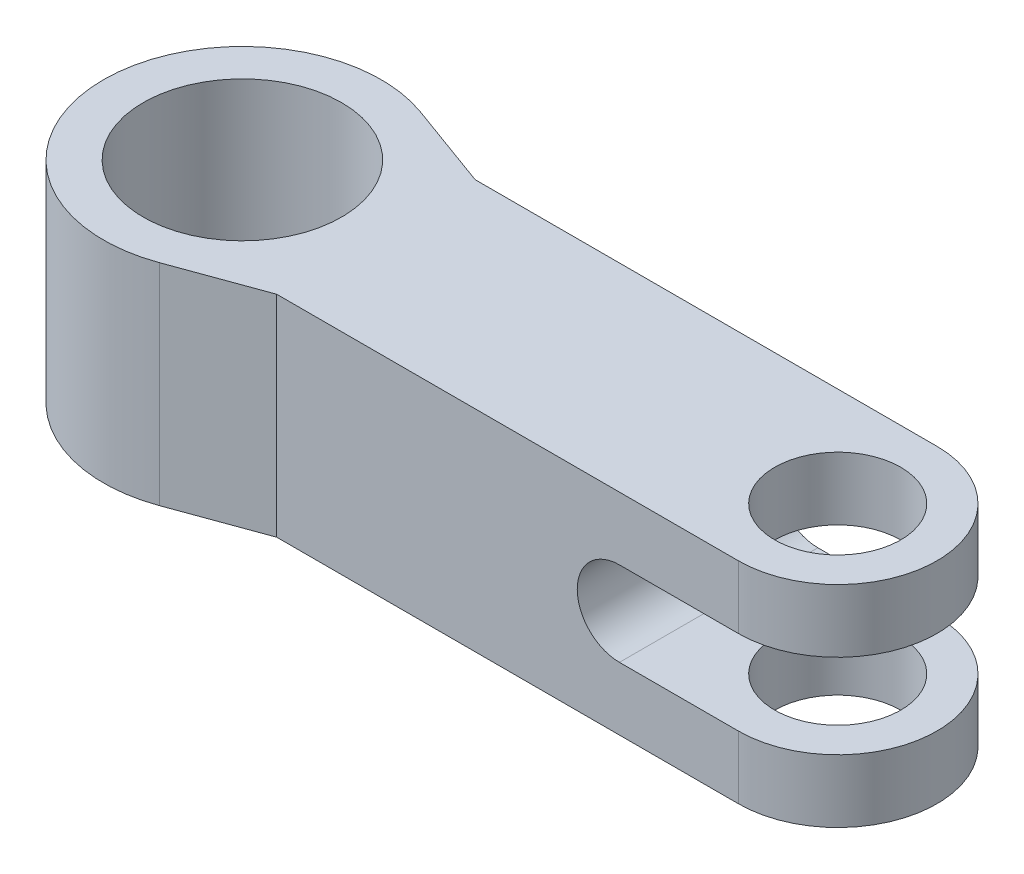
ISO-10303-21;
HEADER;
FILE_DESCRIPTION(('STEP AP214'),'2;1');
FILE_NAME('part.step','',(''),(''),'','','');
FILE_SCHEMA(('AUTOMOTIVE_DESIGN { 1 0 10303 214 1 1 1 1 }'));
ENDSEC;
DATA;
#1=APPLICATION_CONTEXT('core data for automotive mechanical design processes');
#2=APPLICATION_PROTOCOL_DEFINITION('international standard','automotive_design',2000,#1);
#3=PRODUCT_CONTEXT('',#1,'mechanical');
#4=PRODUCT('Part','Part','',(#3));
#5=PRODUCT_RELATED_PRODUCT_CATEGORY('part','',(#4));
#6=PRODUCT_DEFINITION_FORMATION('','',#4);
#7=PRODUCT_DEFINITION_CONTEXT('part definition',#1,'design');
#8=PRODUCT_DEFINITION('design','',#6,#7);
#9=PRODUCT_DEFINITION_SHAPE('','',#8);
#10=(LENGTH_UNIT() NAMED_UNIT(*) SI_UNIT(.MILLI.,.METRE.));
#11=(NAMED_UNIT(*) PLANE_ANGLE_UNIT() SI_UNIT($,.RADIAN.));
#12=(NAMED_UNIT(*) SI_UNIT($,.STERADIAN.) SOLID_ANGLE_UNIT());
#13=UNCERTAINTY_MEASURE_WITH_UNIT(LENGTH_MEASURE(1.E-05),#10,'distance_accuracy_value','');
#14=(GEOMETRIC_REPRESENTATION_CONTEXT(3) GLOBAL_UNCERTAINTY_ASSIGNED_CONTEXT((#13)) GLOBAL_UNIT_ASSIGNED_CONTEXT((#10,
#11,#12)) REPRESENTATION_CONTEXT('',''));
#15=CARTESIAN_POINT('',(0.,0.,0.));
#16=DIRECTION('',(0.,0.,1.));
#17=DIRECTION('',(1.,0.,0.));
#18=AXIS2_PLACEMENT_3D('',#15,#16,#17);
#19=CARTESIAN_POINT('',(16.,-44.175,0.));
#20=DIRECTION('',(0.,-1.,0.));
#21=DIRECTION('',(1.,0.,0.));
#22=AXIS2_PLACEMENT_3D('',#19,#20,#21);
#23=PLANE('',#22);
#24=CARTESIAN_POINT('',(32.,-44.175,0.));
#25=DIRECTION('',(0.,-1.,0.));
#26=DIRECTION('',(0.,0.,-1.));
#27=AXIS2_PLACEMENT_3D('',#24,#25,#26);
#28=CIRCLE('',#27,3.175);
#29=CARTESIAN_POINT('',(32.,-44.175,-3.175));
#30=VERTEX_POINT('',#29);
#31=EDGE_CURVE('E190',#30,#30,#28,.T.);
#32=ORIENTED_EDGE('',*,*,#31,.F.);
#33=EDGE_LOOP('',(#32));
#34=FACE_BOUND('',#33,.T.);
#35=DIRECTION('',(1.,0.,0.));
#36=VECTOR('',#35,1.);
#37=CARTESIAN_POINT('',(20.3646218519343,-44.175,5.));
#38=LINE('',#37,#36);
#39=CARTESIAN_POINT('',(26.,-44.175,5.));
#40=VERTEX_POINT('',#39);
#41=CARTESIAN_POINT('',(32.,-44.175,5.));
#42=VERTEX_POINT('',#41);
#43=EDGE_CURVE('E42',#40,#42,#38,.T.);
#44=ORIENTED_EDGE('',*,*,#43,.F.);
#45=DIRECTION('',(0.,0.,-1.));
#46=VECTOR('',#45,1.);
#47=CARTESIAN_POINT('',(26.,-44.175,0.));
#48=LINE('',#47,#46);
#49=CARTESIAN_POINT('',(26.,-44.175,-5.));
#50=VERTEX_POINT('',#49);
#51=EDGE_CURVE('E200',#40,#50,#48,.T.);
#52=ORIENTED_EDGE('',*,*,#51,.T.);
#53=DIRECTION('',(1.,0.,0.));
#54=VECTOR('',#53,1.);
#55=CARTESIAN_POINT('',(20.3646218519343,-44.175,-5.));
#56=LINE('',#55,#54);
#57=CARTESIAN_POINT('',(32.,-44.175,-5.));
#58=VERTEX_POINT('',#57);
#59=EDGE_CURVE('E176',#50,#58,#56,.T.);
#60=ORIENTED_EDGE('',*,*,#59,.T.);
#61=CARTESIAN_POINT('',(32.,-44.175,0.));
#62=DIRECTION('',(0.,-1.,0.));
#63=DIRECTION('',(0.,0.,-1.));
#64=AXIS2_PLACEMENT_3D('',#61,#62,#63);
#65=CIRCLE('',#64,5.);
#66=EDGE_CURVE('E189',#58,#42,#65,.T.);
#67=ORIENTED_EDGE('',*,*,#66,.T.);
#68=EDGE_LOOP('',(#44,#52,#60,#67));
#69=FACE_BOUND('',#68,.T.);
#70=ADVANCED_FACE('F17',(#34,#69),#23,.T.);
#71=CARTESIAN_POINT('',(2.,-44.302,0.));
#72=DIRECTION('',(0.,1.,0.));
#73=DIRECTION('',(0.,0.,1.));
#74=AXIS2_PLACEMENT_3D('',#71,#72,#73);
#75=CYLINDRICAL_SURFACE('',#74,7.);
#76=CARTESIAN_POINT('',(2.,-41.,0.));
#77=DIRECTION('',(0.,-1.,0.));
#78=DIRECTION('',(0.,0.,-1.));
#79=AXIS2_PLACEMENT_3D('',#76,#77,#78);
#80=CIRCLE('',#79,7.);
#81=CARTESIAN_POINT('',(4.39414100327968,-41.,6.57784834550136));
#82=VERTEX_POINT('',#81);
#83=CARTESIAN_POINT('',(4.39414100327967,-41.,-6.57784834550136));
#84=VERTEX_POINT('',#83);
#85=EDGE_CURVE('E163',#82,#84,#80,.T.);
#86=ORIENTED_EDGE('',*,*,#85,.T.);
#87=DIRECTION('',(0.,1.,0.));
#88=VECTOR('',#87,1.);
#89=CARTESIAN_POINT('',(4.39414100327967,-44.302,-6.57784834550136));
#90=LINE('',#89,#88);
#91=CARTESIAN_POINT('',(4.39414100327967,-51.604,-6.57784834550136));
#92=VERTEX_POINT('',#91);
#93=EDGE_CURVE('E11',#92,#84,#90,.T.);
#94=ORIENTED_EDGE('',*,*,#93,.F.);
#95=CARTESIAN_POINT('',(2.,-51.604,0.));
#96=DIRECTION('',(0.,-1.,0.));
#97=DIRECTION('',(0.,0.,-1.));
#98=AXIS2_PLACEMENT_3D('',#95,#96,#97);
#99=CIRCLE('',#98,7.);
#100=CARTESIAN_POINT('',(4.39414100327968,-51.604,6.57784834550136));
#101=VERTEX_POINT('',#100);
#102=EDGE_CURVE('E232',#101,#92,#99,.T.);
#103=ORIENTED_EDGE('',*,*,#102,.F.);
#104=DIRECTION('',(0.,1.,0.));
#105=VECTOR('',#104,1.);
#106=CARTESIAN_POINT('',(4.39414100327968,-44.302,6.57784834550136));
#107=LINE('',#106,#105);
#108=EDGE_CURVE('E149',#101,#82,#107,.T.);
#109=ORIENTED_EDGE('',*,*,#108,.T.);
#110=EDGE_LOOP('',(#86,#94,#103,#109));
#111=FACE_BOUND('',#110,.T.);
#112=ADVANCED_FACE('F427',(#111),#75,.T.);
#113=CARTESIAN_POINT('',(6.56169235357409,-44.302,-5.78892417275068));
#114=DIRECTION('',(-0.342020143325668,0.,0.939692620785908));
#115=DIRECTION('',(0.939692620785909,0.,0.342020143325668));
#116=AXIS2_PLACEMENT_3D('',#113,#114,#115);
#117=PLANE('',#116);
#118=DIRECTION('',(0.939692620785909,0.,0.342020143325668));
#119=VECTOR('',#118,1.);
#120=CARTESIAN_POINT('',(6.56169235357409,-41.,-5.78892417275068));
#121=LINE('',#120,#119);
#122=CARTESIAN_POINT('',(8.7292437038685,-41.,-5.));
#123=VERTEX_POINT('',#122);
#124=EDGE_CURVE('E261',#84,#123,#121,.T.);
#125=ORIENTED_EDGE('',*,*,#124,.T.);
#126=DIRECTION('',(0.,1.,0.));
#127=VECTOR('',#126,1.);
#128=CARTESIAN_POINT('',(8.7292437038685,-44.302,-5.));
#129=LINE('',#128,#127);
#130=CARTESIAN_POINT('',(8.7292437038685,-51.604,-5.));
#131=VERTEX_POINT('',#130);
#132=EDGE_CURVE('E28',#131,#123,#129,.T.);
#133=ORIENTED_EDGE('',*,*,#132,.F.);
#134=DIRECTION('',(0.939692620785909,0.,0.342020143325668));
#135=VECTOR('',#134,1.);
#136=CARTESIAN_POINT('',(6.56169235357409,-51.604,-5.78892417275068));
#137=LINE('',#136,#135);
#138=EDGE_CURVE('E236',#92,#131,#137,.T.);
#139=ORIENTED_EDGE('',*,*,#138,.F.);
#140=ORIENTED_EDGE('',*,*,#93,.T.);
#141=EDGE_LOOP('',(#125,#133,#139,#140));
#142=FACE_BOUND('',#141,.T.);
#143=ADVANCED_FACE('F421',(#142),#117,.F.);
#144=CARTESIAN_POINT('',(20.3646218519343,-44.302,-5.));
#145=DIRECTION('',(0.,0.,1.));
#146=DIRECTION('',(1.,0.,0.));
#147=AXIS2_PLACEMENT_3D('',#144,#145,#146);
#148=PLANE('',#147);
#149=ORIENTED_EDGE('',*,*,#59,.F.);
#150=CARTESIAN_POINT('',(26.,-46.302,-5.));
#151=DIRECTION('',(0.,0.,1.));
#152=DIRECTION('',(1.,0.,0.));
#153=AXIS2_PLACEMENT_3D('',#150,#151,#152);
#154=CIRCLE('',#153,2.127);
#155=CARTESIAN_POINT('',(26.,-48.429,-5.));
#156=VERTEX_POINT('',#155);
#157=EDGE_CURVE('E92',#50,#156,#154,.T.);
#158=ORIENTED_EDGE('',*,*,#157,.T.);
#159=DIRECTION('',(1.,0.,0.));
#160=VECTOR('',#159,1.);
#161=CARTESIAN_POINT('',(20.3646218519343,-48.429,-5.));
#162=LINE('',#161,#160);
#163=CARTESIAN_POINT('',(32.,-48.429,-5.));
#164=VERTEX_POINT('',#163);
#165=EDGE_CURVE('E67',#156,#164,#162,.T.);
#166=ORIENTED_EDGE('',*,*,#165,.T.);
#167=DIRECTION('',(0.,1.,0.));
#168=VECTOR('',#167,1.);
#169=CARTESIAN_POINT('',(32.,-51.604,-5.));
#170=LINE('',#169,#168);
#171=CARTESIAN_POINT('',(32.,-51.604,-5.));
#172=VERTEX_POINT('',#171);
#173=EDGE_CURVE('E207',#172,#164,#170,.T.);
#174=ORIENTED_EDGE('',*,*,#173,.F.);
#175=DIRECTION('',(1.,0.,0.));
#176=VECTOR('',#175,1.);
#177=CARTESIAN_POINT('',(20.3646218519343,-51.604,-5.));
#178=LINE('',#177,#176);
#179=EDGE_CURVE('E240',#131,#172,#178,.T.);
#180=ORIENTED_EDGE('',*,*,#179,.F.);
#181=ORIENTED_EDGE('',*,*,#132,.T.);
#182=DIRECTION('',(1.,0.,0.));
#183=VECTOR('',#182,1.);
#184=CARTESIAN_POINT('',(20.3646218519343,-41.,-5.));
#185=LINE('',#184,#183);
#186=CARTESIAN_POINT('',(32.,-41.,-5.));
#187=VERTEX_POINT('',#186);
#188=EDGE_CURVE('E157',#123,#187,#185,.T.);
#189=ORIENTED_EDGE('',*,*,#188,.T.);
#190=DIRECTION('',(0.,1.,0.));
#191=VECTOR('',#190,1.);
#192=CARTESIAN_POINT('',(32.,-44.302,-5.));
#193=LINE('',#192,#191);
#194=EDGE_CURVE('E180',#58,#187,#193,.T.);
#195=ORIENTED_EDGE('',*,*,#194,.F.);
#196=EDGE_LOOP('',(#149,#158,#166,#174,#180,#181,#189,#195));
#197=FACE_BOUND('',#196,.T.);
#198=ADVANCED_FACE('F267',(#197),#148,.F.);
#199=CARTESIAN_POINT('',(32.,-44.302,0.));
#200=DIRECTION('',(0.,1.,0.));
#201=DIRECTION('',(0.,0.,1.));
#202=AXIS2_PLACEMENT_3D('',#199,#200,#201);
#203=CYLINDRICAL_SURFACE('',#202,5.);
#204=CARTESIAN_POINT('',(32.,-41.,0.));
#205=DIRECTION('',(0.,-1.,0.));
#206=DIRECTION('',(0.,0.,-1.));
#207=AXIS2_PLACEMENT_3D('',#204,#205,#206);
#208=CIRCLE('',#207,5.);
#209=CARTESIAN_POINT('',(32.,-41.,5.));
#210=VERTEX_POINT('',#209);
#211=EDGE_CURVE('E171',#187,#210,#208,.T.);
#212=ORIENTED_EDGE('',*,*,#211,.T.);
#213=DIRECTION('',(0.,1.,0.));
#214=VECTOR('',#213,1.);
#215=CARTESIAN_POINT('',(32.,-44.302,5.));
#216=LINE('',#215,#214);
#217=EDGE_CURVE('E133',#42,#210,#216,.T.);
#218=ORIENTED_EDGE('',*,*,#217,.F.);
#219=ORIENTED_EDGE('',*,*,#66,.F.);
#220=ORIENTED_EDGE('',*,*,#194,.T.);
#221=EDGE_LOOP('',(#212,#218,#219,#220));
#222=FACE_BOUND('',#221,.T.);
#223=ADVANCED_FACE('F271',(#222),#203,.T.);
#224=CARTESIAN_POINT('',(20.3646218519343,-44.302,5.));
#225=DIRECTION('',(0.,0.,1.));
#226=DIRECTION('',(1.,0.,0.));
#227=AXIS2_PLACEMENT_3D('',#224,#225,#226);
#228=PLANE('',#227);
#229=CARTESIAN_POINT('',(26.,-46.302,5.));
#230=DIRECTION('',(0.,0.,1.));
#231=DIRECTION('',(1.,0.,0.));
#232=AXIS2_PLACEMENT_3D('',#229,#230,#231);
#233=CIRCLE('',#232,2.127);
#234=CARTESIAN_POINT('',(26.,-48.429,5.));
#235=VERTEX_POINT('',#234);
#236=EDGE_CURVE('E217',#40,#235,#233,.T.);
#237=ORIENTED_EDGE('',*,*,#236,.F.);
#238=ORIENTED_EDGE('',*,*,#43,.T.);
#239=ORIENTED_EDGE('',*,*,#217,.T.);
#240=DIRECTION('',(1.,0.,0.));
#241=VECTOR('',#240,1.);
#242=CARTESIAN_POINT('',(20.3646218519343,-41.,5.));
#243=LINE('',#242,#241);
#244=CARTESIAN_POINT('',(8.7292437038685,-41.,5.));
#245=VERTEX_POINT('',#244);
#246=EDGE_CURVE('E152',#245,#210,#243,.T.);
#247=ORIENTED_EDGE('',*,*,#246,.F.);
#248=DIRECTION('',(0.,1.,0.));
#249=VECTOR('',#248,1.);
#250=CARTESIAN_POINT('',(8.7292437038685,-44.302,5.));
#251=LINE('',#250,#249);
#252=CARTESIAN_POINT('',(8.7292437038685,-51.604,5.));
#253=VERTEX_POINT('',#252);
#254=EDGE_CURVE('E140',#253,#245,#251,.T.);
#255=ORIENTED_EDGE('',*,*,#254,.F.);
#256=DIRECTION('',(1.,0.,0.));
#257=VECTOR('',#256,1.);
#258=CARTESIAN_POINT('',(20.3646218519343,-51.604,5.));
#259=LINE('',#258,#257);
#260=CARTESIAN_POINT('',(32.,-51.604,5.));
#261=VERTEX_POINT('',#260);
#262=EDGE_CURVE('E227',#253,#261,#259,.T.);
#263=ORIENTED_EDGE('',*,*,#262,.T.);
#264=DIRECTION('',(0.,1.,0.));
#265=VECTOR('',#264,1.);
#266=CARTESIAN_POINT('',(32.,-51.604,5.));
#267=LINE('',#266,#265);
#268=CARTESIAN_POINT('',(32.,-48.429,5.));
#269=VERTEX_POINT('',#268);
#270=EDGE_CURVE('E251',#261,#269,#267,.T.);
#271=ORIENTED_EDGE('',*,*,#270,.T.);
#272=DIRECTION('',(1.,0.,0.));
#273=VECTOR('',#272,1.);
#274=CARTESIAN_POINT('',(20.3646218519343,-48.429,5.));
#275=LINE('',#274,#273);
#276=EDGE_CURVE('E82',#235,#269,#275,.T.);
#277=ORIENTED_EDGE('',*,*,#276,.F.);
#278=EDGE_LOOP('',(#237,#238,#239,#247,#255,#263,#271,#277));
#279=FACE_BOUND('',#278,.T.);
#280=ADVANCED_FACE('F153',(#279),#228,.T.);
#281=CARTESIAN_POINT('',(6.56169235357409,-44.302,5.78892417275068));
#282=DIRECTION('',(0.342020143325669,0.,0.939692620785908));
#283=DIRECTION('',(0.939692620785909,0.,-0.342020143325669));
#284=AXIS2_PLACEMENT_3D('',#281,#282,#283);
#285=PLANE('',#284);
#286=DIRECTION('',(0.939692620785908,0.,-0.342020143325669));
#287=VECTOR('',#286,1.);
#288=CARTESIAN_POINT('',(6.56169235357409,-41.,5.78892417275068));
#289=LINE('',#288,#287);
#290=EDGE_CURVE('E143',#82,#245,#289,.T.);
#291=ORIENTED_EDGE('',*,*,#290,.F.);
#292=ORIENTED_EDGE('',*,*,#108,.F.);
#293=DIRECTION('',(0.939692620785909,0.,-0.342020143325669));
#294=VECTOR('',#293,1.);
#295=CARTESIAN_POINT('',(6.56169235357409,-51.604,5.78892417275068));
#296=LINE('',#295,#294);
#297=EDGE_CURVE('E145',#101,#253,#296,.T.);
#298=ORIENTED_EDGE('',*,*,#297,.T.);
#299=ORIENTED_EDGE('',*,*,#254,.T.);
#300=EDGE_LOOP('',(#291,#292,#298,#299));
#301=FACE_BOUND('',#300,.T.);
#302=ADVANCED_FACE('F141',(#301),#285,.T.);
#303=CARTESIAN_POINT('',(2.,-44.302,0.));
#304=DIRECTION('',(0.,1.,0.));
#305=DIRECTION('',(0.,0.,1.));
#306=AXIS2_PLACEMENT_3D('',#303,#304,#305);
#307=CYLINDRICAL_SURFACE('',#306,5.);
#308=CARTESIAN_POINT('',(2.,-41.,0.));
#309=DIRECTION('',(0.,-1.,0.));
#310=DIRECTION('',(0.,0.,-1.));
#311=AXIS2_PLACEMENT_3D('',#308,#309,#310);
#312=CIRCLE('',#311,5.);
#313=CARTESIAN_POINT('',(2.,-41.,-5.));
#314=VERTEX_POINT('',#313);
#315=EDGE_CURVE('E203',#314,#314,#312,.T.);
#316=ORIENTED_EDGE('',*,*,#315,.F.);
#317=EDGE_LOOP('',(#316));
#318=FACE_BOUND('',#317,.T.);
#319=CARTESIAN_POINT('',(2.,-51.604,0.));
#320=DIRECTION('',(0.,-1.,0.));
#321=DIRECTION('',(0.,0.,-1.));
#322=AXIS2_PLACEMENT_3D('',#319,#320,#321);
#323=CIRCLE('',#322,5.);
#324=CARTESIAN_POINT('',(2.,-51.604,-5.));
#325=VERTEX_POINT('',#324);
#326=EDGE_CURVE('E213',#325,#325,#323,.T.);
#327=ORIENTED_EDGE('',*,*,#326,.T.);
#328=EDGE_LOOP('',(#327));
#329=FACE_BOUND('',#328,.T.);
#330=ADVANCED_FACE('F306',(#318,#329),#307,.F.);
#331=CARTESIAN_POINT('',(32.,-44.302,0.));
#332=DIRECTION('',(0.,1.,0.));
#333=DIRECTION('',(0.,0.,1.));
#334=AXIS2_PLACEMENT_3D('',#331,#332,#333);
#335=CYLINDRICAL_SURFACE('',#334,3.175);
#336=ORIENTED_EDGE('',*,*,#31,.T.);
#337=EDGE_LOOP('',(#336));
#338=FACE_BOUND('',#337,.T.);
#339=CARTESIAN_POINT('',(32.,-41.,0.));
#340=DIRECTION('',(0.,-1.,0.));
#341=DIRECTION('',(0.,0.,-1.));
#342=AXIS2_PLACEMENT_3D('',#339,#340,#341);
#343=CIRCLE('',#342,3.175);
#344=CARTESIAN_POINT('',(32.,-41.,-3.175));
#345=VERTEX_POINT('',#344);
#346=EDGE_CURVE('E165',#345,#345,#343,.T.);
#347=ORIENTED_EDGE('',*,*,#346,.F.);
#348=EDGE_LOOP('',(#347));
#349=FACE_BOUND('',#348,.T.);
#350=ADVANCED_FACE('F301',(#338,#349),#335,.F.);
#351=CARTESIAN_POINT('',(16.,-41.,0.));
#352=DIRECTION('',(0.,-1.,0.));
#353=DIRECTION('',(1.,0.,0.));
#354=AXIS2_PLACEMENT_3D('',#351,#352,#353);
#355=PLANE('',#354);
#356=ORIENTED_EDGE('',*,*,#315,.T.);
#357=EDGE_LOOP('',(#356));
#358=FACE_BOUND('',#357,.T.);
#359=ORIENTED_EDGE('',*,*,#85,.F.);
#360=ORIENTED_EDGE('',*,*,#290,.T.);
#361=ORIENTED_EDGE('',*,*,#246,.T.);
#362=ORIENTED_EDGE('',*,*,#211,.F.);
#363=ORIENTED_EDGE('',*,*,#188,.F.);
#364=ORIENTED_EDGE('',*,*,#124,.F.);
#365=EDGE_LOOP('',(#359,#360,#361,#362,#363,#364));
#366=FACE_BOUND('',#365,.T.);
#367=ORIENTED_EDGE('',*,*,#346,.T.);
#368=EDGE_LOOP('',(#367));
#369=FACE_BOUND('',#368,.T.);
#370=ADVANCED_FACE('F160',(#358,#366,#369),#355,.F.);
#371=CARTESIAN_POINT('',(32.,-51.604,0.));
#372=DIRECTION('',(0.,1.,0.));
#373=DIRECTION('',(0.,0.,1.));
#374=AXIS2_PLACEMENT_3D('',#371,#372,#373);
#375=CYLINDRICAL_SURFACE('',#374,5.);
#376=CARTESIAN_POINT('',(32.,-48.429,0.));
#377=DIRECTION('',(0.,-1.,0.));
#378=DIRECTION('',(0.,0.,-1.));
#379=AXIS2_PLACEMENT_3D('',#376,#377,#378);
#380=CIRCLE('',#379,5.);
#381=EDGE_CURVE('E210',#164,#269,#380,.T.);
#382=ORIENTED_EDGE('',*,*,#381,.T.);
#383=ORIENTED_EDGE('',*,*,#270,.F.);
#384=CARTESIAN_POINT('',(32.,-51.604,0.));
#385=DIRECTION('',(0.,-1.,0.));
#386=DIRECTION('',(0.,0.,-1.));
#387=AXIS2_PLACEMENT_3D('',#384,#385,#386);
#388=CIRCLE('',#387,5.);
#389=EDGE_CURVE('E248',#172,#261,#388,.T.);
#390=ORIENTED_EDGE('',*,*,#389,.F.);
#391=ORIENTED_EDGE('',*,*,#173,.T.);
#392=EDGE_LOOP('',(#382,#383,#390,#391));
#393=FACE_BOUND('',#392,.T.);
#394=ADVANCED_FACE('F277',(#393),#375,.T.);
#395=CARTESIAN_POINT('',(32.,-51.604,0.));
#396=DIRECTION('',(0.,1.,0.));
#397=DIRECTION('',(0.,0.,1.));
#398=AXIS2_PLACEMENT_3D('',#395,#396,#397);
#399=CYLINDRICAL_SURFACE('',#398,3.175);
#400=CARTESIAN_POINT('',(32.,-51.604,0.));
#401=DIRECTION('',(0.,-1.,0.));
#402=DIRECTION('',(0.,0.,-1.));
#403=AXIS2_PLACEMENT_3D('',#400,#401,#402);
#404=CIRCLE('',#403,3.175);
#405=CARTESIAN_POINT('',(32.,-51.604,-3.175));
#406=VERTEX_POINT('',#405);
#407=EDGE_CURVE('E244',#406,#406,#404,.T.);
#408=ORIENTED_EDGE('',*,*,#407,.T.);
#409=EDGE_LOOP('',(#408));
#410=FACE_BOUND('',#409,.T.);
#411=CARTESIAN_POINT('',(32.,-48.429,0.));
#412=DIRECTION('',(0.,-1.,0.));
#413=DIRECTION('',(0.,0.,-1.));
#414=AXIS2_PLACEMENT_3D('',#411,#412,#413);
#415=CIRCLE('',#414,3.175);
#416=CARTESIAN_POINT('',(32.,-48.429,-3.175));
#417=VERTEX_POINT('',#416);
#418=EDGE_CURVE('E21',#417,#417,#415,.T.);
#419=ORIENTED_EDGE('',*,*,#418,.F.);
#420=EDGE_LOOP('',(#419));
#421=FACE_BOUND('',#420,.T.);
#422=ADVANCED_FACE('F344',(#410,#421),#399,.F.);
#423=CARTESIAN_POINT('',(16.,-51.604,0.));
#424=DIRECTION('',(0.,-1.,0.));
#425=DIRECTION('',(1.,0.,0.));
#426=AXIS2_PLACEMENT_3D('',#423,#424,#425);
#427=PLANE('',#426);
#428=ORIENTED_EDGE('',*,*,#326,.F.);
#429=EDGE_LOOP('',(#428));
#430=FACE_BOUND('',#429,.T.);
#431=ORIENTED_EDGE('',*,*,#179,.T.);
#432=ORIENTED_EDGE('',*,*,#389,.T.);
#433=ORIENTED_EDGE('',*,*,#262,.F.);
#434=ORIENTED_EDGE('',*,*,#297,.F.);
#435=ORIENTED_EDGE('',*,*,#102,.T.);
#436=ORIENTED_EDGE('',*,*,#138,.T.);
#437=EDGE_LOOP('',(#431,#432,#433,#434,#435,#436));
#438=FACE_BOUND('',#437,.T.);
#439=ORIENTED_EDGE('',*,*,#407,.F.);
#440=EDGE_LOOP('',(#439));
#441=FACE_BOUND('',#440,.T.);
#442=ADVANCED_FACE('F280',(#430,#438,#441),#427,.T.);
#443=CARTESIAN_POINT('',(16.,-48.429,0.));
#444=DIRECTION('',(0.,-1.,0.));
#445=DIRECTION('',(1.,0.,0.));
#446=AXIS2_PLACEMENT_3D('',#443,#444,#445);
#447=PLANE('',#446);
#448=DIRECTION('',(0.,0.,-1.));
#449=VECTOR('',#448,1.);
#450=CARTESIAN_POINT('',(26.,-48.429,0.));
#451=LINE('',#450,#449);
#452=EDGE_CURVE('E204',#235,#156,#451,.T.);
#453=ORIENTED_EDGE('',*,*,#452,.F.);
#454=ORIENTED_EDGE('',*,*,#276,.T.);
#455=ORIENTED_EDGE('',*,*,#381,.F.);
#456=ORIENTED_EDGE('',*,*,#165,.F.);
#457=EDGE_LOOP('',(#453,#454,#455,#456));
#458=FACE_BOUND('',#457,.T.);
#459=ORIENTED_EDGE('',*,*,#418,.T.);
#460=EDGE_LOOP('',(#459));
#461=FACE_BOUND('',#460,.T.);
#462=ADVANCED_FACE('F19',(#458,#461),#447,.F.);
#463=CARTESIAN_POINT('',(26.,-46.302,-166.607676777249));
#464=DIRECTION('',(0.,0.,1.));
#465=DIRECTION('',(1.,0.,0.));
#466=AXIS2_PLACEMENT_3D('',#463,#464,#465);
#467=CYLINDRICAL_SURFACE('',#466,2.127);
#468=ORIENTED_EDGE('',*,*,#51,.F.);
#469=ORIENTED_EDGE('',*,*,#236,.T.);
#470=ORIENTED_EDGE('',*,*,#452,.T.);
#471=ORIENTED_EDGE('',*,*,#157,.F.);
#472=EDGE_LOOP('',(#468,#469,#470,#471));
#473=FACE_BOUND('',#472,.T.);
#474=ADVANCED_FACE('F273',(#473),#467,.F.);
#475=CLOSED_SHELL('',(#70,#112,#143,#198,#223,#280,#302,#330,#350,#370,#394,#422,#442,#462,#474));
#476=MANIFOLD_SOLID_BREP('B1',#475);
#477=ADVANCED_BREP_SHAPE_REPRESENTATION('',(#18,#476),#14);
#478=SHAPE_DEFINITION_REPRESENTATION(#9,#477);
ENDSEC;
END-ISO-10303-21;
